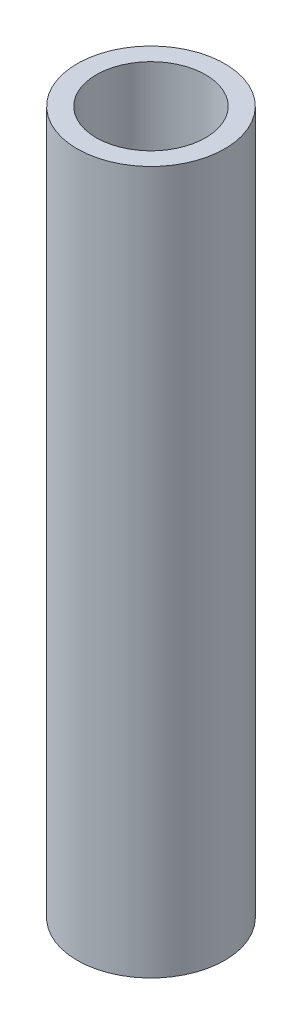
ISO-10303-21;
HEADER;
FILE_DESCRIPTION(('STEP AP214'),'2;1');
FILE_NAME('part.step','',(''),(''),'','','');
FILE_SCHEMA(('AUTOMOTIVE_DESIGN { 1 0 10303 214 1 1 1 1 }'));
ENDSEC;
DATA;
#1=APPLICATION_CONTEXT('core data for automotive mechanical design processes');
#2=APPLICATION_PROTOCOL_DEFINITION('international standard','automotive_design',2000,#1);
#3=PRODUCT_CONTEXT('',#1,'mechanical');
#4=PRODUCT('Part','Part','',(#3));
#5=PRODUCT_RELATED_PRODUCT_CATEGORY('part','',(#4));
#6=PRODUCT_DEFINITION_FORMATION('','',#4);
#7=PRODUCT_DEFINITION_CONTEXT('part definition',#1,'design');
#8=PRODUCT_DEFINITION('design','',#6,#7);
#9=PRODUCT_DEFINITION_SHAPE('','',#8);
#10=(LENGTH_UNIT() NAMED_UNIT(*) SI_UNIT(.MILLI.,.METRE.));
#11=(NAMED_UNIT(*) PLANE_ANGLE_UNIT() SI_UNIT($,.RADIAN.));
#12=(NAMED_UNIT(*) SI_UNIT($,.STERADIAN.) SOLID_ANGLE_UNIT());
#13=UNCERTAINTY_MEASURE_WITH_UNIT(LENGTH_MEASURE(1.E-05),#10,'distance_accuracy_value','');
#14=(GEOMETRIC_REPRESENTATION_CONTEXT(3) GLOBAL_UNCERTAINTY_ASSIGNED_CONTEXT((#13)) GLOBAL_UNIT_ASSIGNED_CONTEXT((#10,
#11,#12)) REPRESENTATION_CONTEXT('',''));
#15=CARTESIAN_POINT('',(0.,0.,0.));
#16=DIRECTION('',(0.,0.,1.));
#17=DIRECTION('',(1.,0.,0.));
#18=AXIS2_PLACEMENT_3D('',#15,#16,#17);
#19=CARTESIAN_POINT('',(0.,0.,0.));
#20=DIRECTION('',(0.,1.,0.));
#21=DIRECTION('',(0.,0.,1.));
#22=AXIS2_PLACEMENT_3D('',#19,#20,#21);
#23=CYLINDRICAL_SURFACE('',#22,7.8994);
#24=CARTESIAN_POINT('',(0.,101.6,0.));
#25=DIRECTION('',(0.,1.,0.));
#26=DIRECTION('',(0.,0.,1.));
#27=AXIS2_PLACEMENT_3D('',#24,#25,#26);
#28=CIRCLE('',#27,7.8994);
#29=CARTESIAN_POINT('',(0.,101.6,7.8994));
#30=VERTEX_POINT('',#29);
#31=EDGE_CURVE('E18',#30,#30,#28,.F.);
#32=ORIENTED_EDGE('',*,*,#31,.F.);
#33=EDGE_LOOP('',(#32));
#34=FACE_BOUND('',#33,.T.);
#35=CARTESIAN_POINT('',(0.,0.,0.));
#36=DIRECTION('',(0.,1.,0.));
#37=DIRECTION('',(0.,0.,1.));
#38=AXIS2_PLACEMENT_3D('',#35,#36,#37);
#39=CIRCLE('',#38,7.8994);
#40=CARTESIAN_POINT('',(0.,0.,7.8994));
#41=VERTEX_POINT('',#40);
#42=EDGE_CURVE('E27',#41,#41,#39,.F.);
#43=ORIENTED_EDGE('',*,*,#42,.T.);
#44=EDGE_LOOP('',(#43));
#45=FACE_BOUND('',#44,.T.);
#46=ADVANCED_FACE('F15',(#34,#45),#23,.F.);
#47=CARTESIAN_POINT('',(0.,101.6,0.));
#48=DIRECTION('',(0.,1.,0.));
#49=DIRECTION('',(0.,0.,1.));
#50=AXIS2_PLACEMENT_3D('',#47,#48,#49);
#51=PLANE('',#50);
#52=ORIENTED_EDGE('',*,*,#31,.T.);
#53=EDGE_LOOP('',(#52));
#54=FACE_BOUND('',#53,.T.);
#55=CARTESIAN_POINT('',(0.,101.6,0.));
#56=DIRECTION('',(0.,1.,0.));
#57=DIRECTION('',(0.,0.,1.));
#58=AXIS2_PLACEMENT_3D('',#55,#56,#57);
#59=CIRCLE('',#58,10.668);
#60=CARTESIAN_POINT('',(0.,101.6,10.668));
#61=VERTEX_POINT('',#60);
#62=EDGE_CURVE('E22',#61,#61,#59,.F.);
#63=ORIENTED_EDGE('',*,*,#62,.F.);
#64=EDGE_LOOP('',(#63));
#65=FACE_BOUND('',#64,.T.);
#66=ADVANCED_FACE('F35',(#54,#65),#51,.T.);
#67=CARTESIAN_POINT('',(0.,0.,0.));
#68=DIRECTION('',(0.,1.,0.));
#69=DIRECTION('',(0.,0.,1.));
#70=AXIS2_PLACEMENT_3D('',#67,#68,#69);
#71=PLANE('',#70);
#72=ORIENTED_EDGE('',*,*,#42,.F.);
#73=EDGE_LOOP('',(#72));
#74=FACE_BOUND('',#73,.T.);
#75=CARTESIAN_POINT('',(0.,0.,0.));
#76=DIRECTION('',(0.,1.,0.));
#77=DIRECTION('',(0.,0.,1.));
#78=AXIS2_PLACEMENT_3D('',#75,#76,#77);
#79=CIRCLE('',#78,10.668);
#80=CARTESIAN_POINT('',(0.,0.,10.668));
#81=VERTEX_POINT('',#80);
#82=EDGE_CURVE('E10',#81,#81,#79,.T.);
#83=ORIENTED_EDGE('',*,*,#82,.F.);
#84=EDGE_LOOP('',(#83));
#85=FACE_BOUND('',#84,.T.);
#86=ADVANCED_FACE('F43',(#74,#85),#71,.F.);
#87=CARTESIAN_POINT('',(0.,0.,0.));
#88=DIRECTION('',(0.,1.,0.));
#89=DIRECTION('',(0.,0.,1.));
#90=AXIS2_PLACEMENT_3D('',#87,#88,#89);
#91=CYLINDRICAL_SURFACE('',#90,10.668);
#92=ORIENTED_EDGE('',*,*,#62,.T.);
#93=EDGE_LOOP('',(#92));
#94=FACE_BOUND('',#93,.T.);
#95=ORIENTED_EDGE('',*,*,#82,.T.);
#96=EDGE_LOOP('',(#95));
#97=FACE_BOUND('',#96,.T.);
#98=ADVANCED_FACE('F44',(#94,#97),#91,.T.);
#99=CLOSED_SHELL('',(#46,#66,#86,#98));
#100=MANIFOLD_SOLID_BREP('B1',#99);
#101=ADVANCED_BREP_SHAPE_REPRESENTATION('',(#18,#100),#14);
#102=SHAPE_DEFINITION_REPRESENTATION(#9,#101);
ENDSEC;
END-ISO-10303-21;
